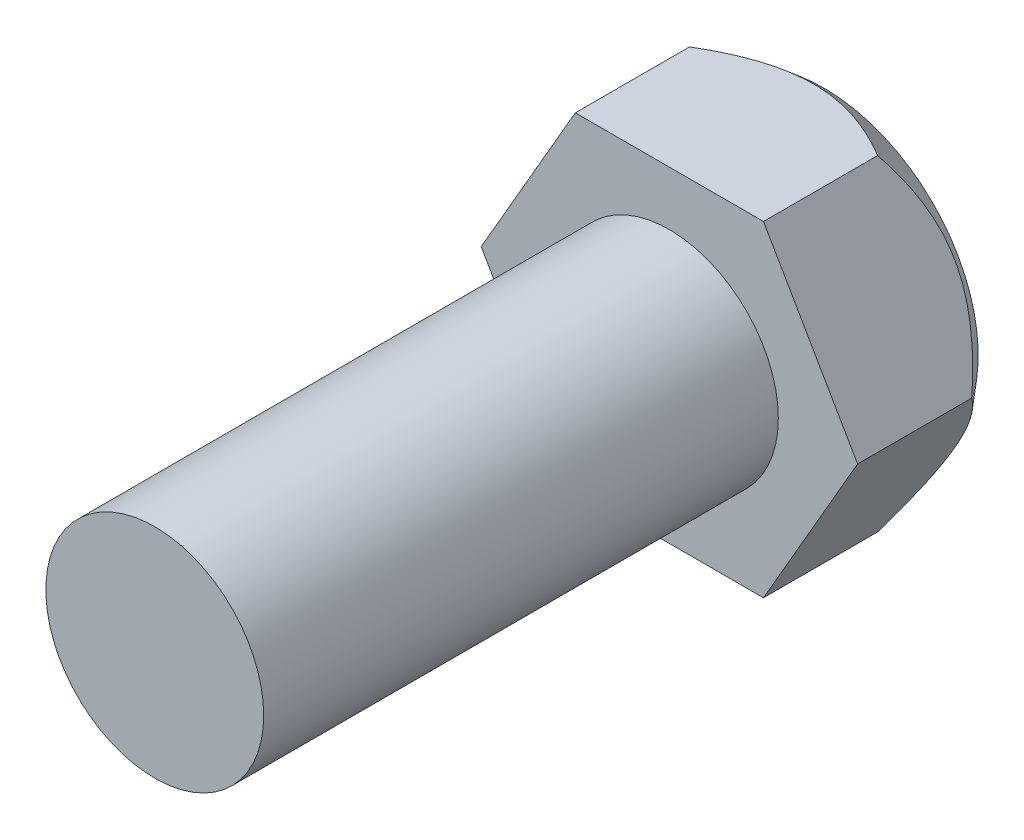
ISO-10303-21;
HEADER;
FILE_DESCRIPTION(('STEP AP214'),'2;1');
FILE_NAME('part.step','',(''),(''),'','','');
FILE_SCHEMA(('AUTOMOTIVE_DESIGN { 1 0 10303 214 1 1 1 1 }'));
ENDSEC;
DATA;
#1=APPLICATION_CONTEXT('core data for automotive mechanical design processes');
#2=APPLICATION_PROTOCOL_DEFINITION('international standard','automotive_design',2000,#1);
#3=PRODUCT_CONTEXT('',#1,'mechanical');
#4=PRODUCT('Part','Part','',(#3));
#5=PRODUCT_RELATED_PRODUCT_CATEGORY('part','',(#4));
#6=PRODUCT_DEFINITION_FORMATION('','',#4);
#7=PRODUCT_DEFINITION_CONTEXT('part definition',#1,'design');
#8=PRODUCT_DEFINITION('design','',#6,#7);
#9=PRODUCT_DEFINITION_SHAPE('','',#8);
#10=(LENGTH_UNIT() NAMED_UNIT(*) SI_UNIT(.MILLI.,.METRE.));
#11=(NAMED_UNIT(*) PLANE_ANGLE_UNIT() SI_UNIT($,.RADIAN.));
#12=(NAMED_UNIT(*) SI_UNIT($,.STERADIAN.) SOLID_ANGLE_UNIT());
#13=UNCERTAINTY_MEASURE_WITH_UNIT(LENGTH_MEASURE(1.E-05),#10,'distance_accuracy_value','');
#14=(GEOMETRIC_REPRESENTATION_CONTEXT(3) GLOBAL_UNCERTAINTY_ASSIGNED_CONTEXT((#13)) GLOBAL_UNIT_ASSIGNED_CONTEXT((#10,
#11,#12)) REPRESENTATION_CONTEXT('',''));
#15=CARTESIAN_POINT('',(0.,0.,0.));
#16=DIRECTION('',(0.,0.,1.));
#17=DIRECTION('',(1.,0.,0.));
#18=AXIS2_PLACEMENT_3D('',#15,#16,#17);
#19=CARTESIAN_POINT('',(5.48482755730144,-9.50000000000001,9.));
#20=DIRECTION('',(-0.866025403784439,0.5,0.));
#21=DIRECTION('',(-0.5,-0.866025403784439,0.));
#22=AXIS2_PLACEMENT_3D('',#19,#20,#21);
#23=PLANE('',#22);
#24=CARTESIAN_POINT('',(10.9697705846567,0.000199999999999126,2.34748117302384));
#25=CARTESIAN_POINT('',(10.8889631236256,-0.139762628136546,2.25119255660509));
#26=CARTESIAN_POINT('',(10.8074516206601,-0.280944692674171,2.15722410493489));
#27=CARTESIAN_POINT('',(10.6428919516378,-0.565970400297508,1.97465264818792));
#28=CARTESIAN_POINT('',(10.5598430773367,-0.70981527009836,1.88605220064243));
#29=CARTESIAN_POINT('',(10.3916269708672,-1.00117411315497,1.71449450025603));
#30=CARTESIAN_POINT('',(10.3064496747432,-1.148705517693,1.63157640770944));
#31=CARTESIAN_POINT('',(10.1344587779636,-1.4466024893547,1.47295144758015));
#32=CARTESIAN_POINT('',(10.0476453873572,-1.59696769266219,1.3972436617586));
#33=CARTESIAN_POINT('',(9.78407603193207,-2.05348320757677,1.18197003005541));
#34=CARTESIAN_POINT('',(9.60467446547095,-2.36421583564486,1.05475937532204));
#35=CARTESIAN_POINT('',(9.3312407472385,-2.83781692812593,0.895743862949519));
#36=CARTESIAN_POINT('',(9.23947448417499,-2.99676075817267,0.848072738226419));
#37=CARTESIAN_POINT('',(9.05463564466816,-3.31691101941057,0.764317767209321));
#38=CARTESIAN_POINT('',(8.96156335113909,-3.47811696057988,0.728231450636295));
#39=CARTESIAN_POINT('',(8.74867053636124,-3.84685813234147,0.660405624292135));
#40=CARTESIAN_POINT('',(8.62852975588101,-4.05494806819422,0.632587455626409));
#41=CARTESIAN_POINT('',(8.38745786775192,-4.47249682671035,0.59868379874282));
#42=CARTESIAN_POINT('',(8.26652662858869,-4.68195587716333,0.592602024187488));
#43=CARTESIAN_POINT('',(8.02554412999726,-5.09934980845859,0.602460285817408));
#44=CARTESIAN_POINT('',(7.90549164846371,-5.30728680604941,0.618281405205956));
#45=CARTESIAN_POINT('',(7.66656114341887,-5.72112658026518,0.670946349591678));
#46=CARTESIAN_POINT('',(7.5476831788669,-5.92702925476956,0.707791224556004));
#47=CARTESIAN_POINT('',(7.27901663014141,-6.39237336745628,0.813824983597897));
#48=CARTESIAN_POINT('',(7.12983472906172,-6.65076399969602,0.88916217615276));
#49=CARTESIAN_POINT('',(6.83555773220789,-7.16046670974564,1.0669119730065));
#50=CARTESIAN_POINT('',(6.69046491871772,-7.41177483452373,1.1693393787636));
#51=CARTESIAN_POINT('',(6.40416862365883,-7.90765456358446,1.39682940346883));
#52=CARTESIAN_POINT('',(6.26298312988891,-8.15219501208565,1.52198139490059));
#53=CARTESIAN_POINT('',(5.98502975498372,-8.63362437955669,1.79020900309984));
#54=CARTESIAN_POINT('',(5.84826040158438,-8.87051584856269,1.93327856721327));
#55=CARTESIAN_POINT('',(5.67500706386687,-9.17059943207032,2.12643782180611));
#56=CARTESIAN_POINT('',(5.63665791166208,-9.2370221121162,2.16996231272736));
#57=CARTESIAN_POINT('',(5.56039335536991,-9.36911619843093,2.25798168632233));
#58=CARTESIAN_POINT('',(5.52247699065834,-9.43478926854968,2.30247323861663));
#59=CARTESIAN_POINT('',(5.4847120872476,-9.50020000000001,2.34748117302384));
#60=B_SPLINE_CURVE_WITH_KNOTS('',3,(#24,#25,#26,#27,#28,#29,#30,#31,#32,#33,#34,#35,#36,#37,#38,
#39,#40,#41,#42,#43,#44,#45,#46,#47,#48,#49,#50,#51,#52,#53,#54,#55,#56,#57,#58,#59),
.UNSPECIFIED.,.F.,.F.,(4,2,2,2,2,2,2,2,2,2,2,2,2,2,2,2,2,4),(0.,0.56438501152082,
1.12903683762339,1.69725362189766,2.26539794623585,3.40495025474592,3.97351451521625,
4.5419574576039,5.26665033738531,5.99146702501464,6.71236388040615,7.43329674193717,
8.35490415251259,9.2770161517863,10.202836486913,11.1283449142103,11.3929028603484,
11.6566612332654),.UNSPECIFIED.);
#61=CARTESIAN_POINT('',(10.9696551146029,0.,2.34734355899955));
#62=VERTEX_POINT('',#61);
#63=CARTESIAN_POINT('',(5.48482755730144,-9.50000000000001,2.34734355899955));
#64=VERTEX_POINT('',#63);
#65=EDGE_CURVE('E50',#62,#64,#60,.T.);
#66=ORIENTED_EDGE('',*,*,#65,.F.);
#67=DIRECTION('',(0.,0.,-1.));
#68=VECTOR('',#67,1.);
#69=CARTESIAN_POINT('',(10.9696551146029,0.,9.));
#70=LINE('',#69,#68);
#71=CARTESIAN_POINT('',(10.9696551146029,0.,9.));
#72=VERTEX_POINT('',#71);
#73=EDGE_CURVE('E11',#72,#62,#70,.T.);
#74=ORIENTED_EDGE('',*,*,#73,.F.);
#75=DIRECTION('',(0.5,0.866025403784439,0.));
#76=VECTOR('',#75,1.);
#77=CARTESIAN_POINT('',(5.48482755730144,-9.50000000000001,9.));
#78=LINE('',#77,#76);
#79=CARTESIAN_POINT('',(5.48482755730144,-9.50000000000001,9.));
#80=VERTEX_POINT('',#79);
#81=EDGE_CURVE('E188',#80,#72,#78,.T.);
#82=ORIENTED_EDGE('',*,*,#81,.F.);
#83=DIRECTION('',(0.,0.,-1.));
#84=VECTOR('',#83,1.);
#85=CARTESIAN_POINT('',(5.48482755730144,-9.50000000000001,9.));
#86=LINE('',#85,#84);
#87=EDGE_CURVE('E107',#80,#64,#86,.T.);
#88=ORIENTED_EDGE('',*,*,#87,.T.);
#89=EDGE_LOOP('',(#66,#74,#82,#88));
#90=FACE_BOUND('',#89,.T.);
#91=ADVANCED_FACE('F35',(#90),#23,.F.);
#92=CARTESIAN_POINT('',(10.9696551146029,0.,9.));
#93=DIRECTION('',(-0.866025403784439,-0.5,0.));
#94=DIRECTION('',(0.5,-0.866025403784439,0.));
#95=AXIS2_PLACEMENT_3D('',#92,#93,#94);
#96=PLANE('',#95);
#97=CARTESIAN_POINT('',(5.48471208724761,9.5002,2.34748117302384));
#98=CARTESIAN_POINT('',(5.56551954827873,9.36023737186346,2.25119255660509));
#99=CARTESIAN_POINT('',(5.64703105124427,9.21905530732583,2.15722410493489));
#100=CARTESIAN_POINT('',(5.81159072026657,8.93402959970249,1.97465264818793));
#101=CARTESIAN_POINT('',(5.89463959456764,8.79018472990164,1.88605220064243));
#102=CARTESIAN_POINT('',(6.06285570103715,8.49882588684503,1.71449450025603));
#103=CARTESIAN_POINT('',(6.1480329971611,8.351294482307,1.63157640770944));
#104=CARTESIAN_POINT('',(6.32002389394076,8.0533975106453,1.47295144758015));
#105=CARTESIAN_POINT('',(6.4068372845471,7.90303230733781,1.39724366175861));
#106=CARTESIAN_POINT('',(6.67040663997227,7.44651679242323,1.18197003005541));
#107=CARTESIAN_POINT('',(6.84980820643338,7.13578416435514,1.05475937532204));
#108=CARTESIAN_POINT('',(7.12324192466583,6.66218307187407,0.895743862949518));
#109=CARTESIAN_POINT('',(7.21500818772935,6.50323924182733,0.848072738226418));
#110=CARTESIAN_POINT('',(7.39984702723618,6.18308898058942,0.764317767209322));
#111=CARTESIAN_POINT('',(7.49291932076524,6.02188303942012,0.728231450636296));
#112=CARTESIAN_POINT('',(7.70581213554309,5.65314186765853,0.660405624292135));
#113=CARTESIAN_POINT('',(7.82595291602333,5.44505193180578,0.632587455626409));
#114=CARTESIAN_POINT('',(8.06702480415241,5.02750317328965,0.598683798742819));
#115=CARTESIAN_POINT('',(8.18795604331565,4.81804412283666,0.592602024187487));
#116=CARTESIAN_POINT('',(8.42893854190708,4.4006501915414,0.602460285817408));
#117=CARTESIAN_POINT('',(8.54899102344062,4.19271319395058,0.618281405205957));
#118=CARTESIAN_POINT('',(8.78792152848547,3.77887341973482,0.670946349591679));
#119=CARTESIAN_POINT('',(8.90679949303744,3.57297074523044,0.707791224556005));
#120=CARTESIAN_POINT('',(9.17546604176293,3.10762663254371,0.813824983597896));
#121=CARTESIAN_POINT('',(9.32464794284262,2.84923600030397,0.88916217615276));
#122=CARTESIAN_POINT('',(9.61892493969644,2.33953329025436,1.0669119730065));
#123=CARTESIAN_POINT('',(9.76401775318662,2.08822516547627,1.1693393787636));
#124=CARTESIAN_POINT('',(10.0503140482455,1.59234543641554,1.39682940346883));
#125=CARTESIAN_POINT('',(10.1914995420154,1.34780498791434,1.52198139490059));
#126=CARTESIAN_POINT('',(10.4694529169206,0.866375620443301,1.79020900309984));
#127=CARTESIAN_POINT('',(10.60622227032,0.629484151437311,1.93327856721327));
#128=CARTESIAN_POINT('',(10.7794756080375,0.32940056792968,2.12643782180611));
#129=CARTESIAN_POINT('',(10.8178247602423,0.262977887883805,2.16996231272736));
#130=CARTESIAN_POINT('',(10.8940893165344,0.13088380156907,2.25798168632233));
#131=CARTESIAN_POINT('',(10.932005681246,0.0652107314503242,2.30247323861662));
#132=CARTESIAN_POINT('',(10.9697705846567,-0.00020000000000228,2.34748117302384));
#133=B_SPLINE_CURVE_WITH_KNOTS('',3,(#97,#98,#99,#100,#101,#102,#103,#104,#105,#106,#107,#108,
#109,#110,#111,#112,#113,#114,#115,#116,#117,#118,#119,#120,#121,#122,#123,#124,#125,#126,#127,
#128,#129,#130,#131,#132),.UNSPECIFIED.,.F.,.F.,(4,2,2,2,2,2,2,2,2,2,2,2,2,2,2,2,2,4),(0.,
0.564385011520822,1.12903683762339,1.69725362189766,2.26539794623586,3.40495025474592,
3.97351451521625,4.54195745760391,5.26665033738532,5.99146702501465,6.71236388040615,
7.43329674193718,8.3549041525126,9.27701615178632,10.2028364869131,11.1283449142103,
11.3929028603484,11.6566612332654),.UNSPECIFIED.);
#134=CARTESIAN_POINT('',(5.48482755730145,9.5,2.34734355899955));
#135=VERTEX_POINT('',#134);
#136=EDGE_CURVE('E128',#135,#62,#133,.T.);
#137=ORIENTED_EDGE('',*,*,#136,.F.);
#138=DIRECTION('',(0.,0.,-1.));
#139=VECTOR('',#138,1.);
#140=CARTESIAN_POINT('',(5.48482755730145,9.5,9.));
#141=LINE('',#140,#139);
#142=CARTESIAN_POINT('',(5.48482755730145,9.5,9.));
#143=VERTEX_POINT('',#142);
#144=EDGE_CURVE('E43',#143,#135,#141,.T.);
#145=ORIENTED_EDGE('',*,*,#144,.F.);
#146=DIRECTION('',(-0.5,0.866025403784439,0.));
#147=VECTOR('',#146,1.);
#148=CARTESIAN_POINT('',(10.9696551146029,0.,9.));
#149=LINE('',#148,#147);
#150=EDGE_CURVE('E127',#72,#143,#149,.T.);
#151=ORIENTED_EDGE('',*,*,#150,.F.);
#152=ORIENTED_EDGE('',*,*,#73,.T.);
#153=EDGE_LOOP('',(#137,#145,#151,#152));
#154=FACE_BOUND('',#153,.T.);
#155=ADVANCED_FACE('F126',(#154),#96,.F.);
#156=CARTESIAN_POINT('',(5.48482755730145,9.5,9.));
#157=DIRECTION('',(0.,-1.,0.));
#158=DIRECTION('',(1.,0.,0.));
#159=AXIS2_PLACEMENT_3D('',#156,#157,#158);
#160=PLANE('',#159);
#161=CARTESIAN_POINT('',(-10.7681035727974,9.5,6.38748615066247));
#162=CARTESIAN_POINT('',(-10.519290316109,9.5,6.16517777316281));
#163=CARTESIAN_POINT('',(-10.2688347119545,9.5,5.94467883301882));
#164=CARTESIAN_POINT('',(-9.76398312273237,9.5,5.50810966826671));
#165=CARTESIAN_POINT('',(-9.50958612975656,9.5,5.29204061043584));
#166=CARTESIAN_POINT('',(-8.99412158524951,9.5,4.86342551831856));
#167=CARTESIAN_POINT('',(-8.73301551542346,9.5,4.65092565764778));
#168=CARTESIAN_POINT('',(-8.20553096549107,9.5,4.23259853938085));
#169=CARTESIAN_POINT('',(-7.93915290637596,9.5,4.02677075242545));
#170=CARTESIAN_POINT('',(-7.38505691052174,9.5,3.6119587820503));
#171=CARTESIAN_POINT('',(-7.09698187617145,9.5,3.40344930755562));
#172=CARTESIAN_POINT('',(-6.51269668841927,9.5,2.99796175837351));
#173=CARTESIAN_POINT('',(-6.21648498824425,9.5,2.8009858988175));
#174=CARTESIAN_POINT('',(-5.61570779482363,9.5,2.42252590657691));
#175=CARTESIAN_POINT('',(-5.31117524419953,9.5,2.24098986330625));
#176=CARTESIAN_POINT('',(-4.69158790523013,9.5,1.89701412326009));
#177=CARTESIAN_POINT('',(-4.37653877681122,9.5,1.73456436060275));
#178=CARTESIAN_POINT('',(-3.81367362682312,9.5,1.47119998935354));
#179=CARTESIAN_POINT('',(-3.56836303555361,9.5,1.36497420288798));
#180=CARTESIAN_POINT('',(-3.19539430670949,9.5,1.21834607604793));
#181=CARTESIAN_POINT('',(-3.07022566364014,9.5,1.17158468490425));
#182=CARTESIAN_POINT('',(-2.81821055883197,9.5,1.08267441874355));
#183=CARTESIAN_POINT('',(-2.69136348815049,9.5,1.04052727225815));
#184=CARTESIAN_POINT('',(-2.31129382328237,9.5,0.922518694070893));
#185=CARTESIAN_POINT('',(-2.05573661609763,9.5,0.853971125557394));
#186=CARTESIAN_POINT('',(-1.53962951679316,9.5,0.73962186332583));
#187=CARTESIAN_POINT('',(-1.27908159579638,9.5,0.693811374250513));
#188=CARTESIAN_POINT('',(-0.781744371475834,9.5,0.630724663342835));
#189=CARTESIAN_POINT('',(-0.545267802468872,9.5,0.610998152788053));
#190=CARTESIAN_POINT('',(-0.0715083923209196,9.5,0.592682782762691));
#191=CARTESIAN_POINT('',(0.165774358186825,9.5,0.594091621000563));
#192=CARTESIAN_POINT('',(0.639560229433643,9.5,0.617993057487313));
#193=CARTESIAN_POINT('',(0.876062008053896,9.5,0.640511959498016));
#194=CARTESIAN_POINT('',(1.34628444787561,9.5,0.705606539356792));
#195=CARTESIAN_POINT('',(1.58000458525725,9.5,0.748185935455673));
#196=CARTESIAN_POINT('',(2.120878560086,9.5,0.868941091784143));
#197=CARTESIAN_POINT('',(2.42643893016145,9.5,0.954260133743078));
#198=CARTESIAN_POINT('',(3.02853010532176,9.5,1.15224364217958));
#199=CARTESIAN_POINT('',(3.32505638025887,9.5,1.26492158179527));
#200=CARTESIAN_POINT('',(3.91212807142735,9.5,1.51385516995853));
#201=CARTESIAN_POINT('',(4.20255990716701,9.5,1.65037610493409));
#202=CARTESIAN_POINT('',(4.63119101615597,9.5,1.86859343680778));
#203=CARTESIAN_POINT('',(4.77288377526247,9.5,1.94356309884775));
#204=CARTESIAN_POINT('',(5.05407574724106,9.5,2.09751322708265));
#205=CARTESIAN_POINT('',(5.19357497679054,9.5,2.17649366276439));
#206=CARTESIAN_POINT('',(5.5679524356798,9.5,2.39486361812823));
#207=CARTESIAN_POINT('',(5.80085403576646,9.5,2.53764450777493));
#208=CARTESIAN_POINT('',(6.26124522840037,9.5,2.83171415228251));
#209=CARTESIAN_POINT('',(6.48873384238482,9.5,2.98300442909431));
#210=CARTESIAN_POINT('',(6.93902303247019,9.5,3.29271617148989));
#211=CARTESIAN_POINT('',(7.16182022398099,9.5,3.45114254301658));
#212=CARTESIAN_POINT('',(7.60310617484855,9.5,3.77384244681173));
#213=CARTESIAN_POINT('',(7.8215951736152,9.5,3.93811565273557));
#214=CARTESIAN_POINT('',(8.25566144714915,9.5,4.27225452947675));
#215=CARTESIAN_POINT('',(8.47122328427096,9.5,4.44214021111729));
#216=CARTESIAN_POINT('',(8.89897491584893,9.5,4.78611099032422));
#217=CARTESIAN_POINT('',(9.11116457975042,9.5,4.96019624982471));
#218=CARTESIAN_POINT('',(9.74311019391394,9.5,5.48765176988434));
#219=CARTESIAN_POINT('',(10.1584165141001,9.5,5.84635710612678));
#220=CARTESIAN_POINT('',(10.9464663675653,9.5,6.54484928513815));
#221=CARTESIAN_POINT('',(11.3199369711359,9.5,6.88382190232228));
#222=CARTESIAN_POINT('',(12.0604906625077,9.5,7.56873743211226));
#223=CARTESIAN_POINT('',(12.4275731021824,9.5,7.91468104438172));
#224=CARTESIAN_POINT('',(13.1530834543696,9.5,8.60882843074878));
#225=CARTESIAN_POINT('',(13.5115600743294,9.5,8.95698141018574));
#226=CARTESIAN_POINT('',(14.0460106823566,9.5,9.48244823877507));
#227=CARTESIAN_POINT('',(14.2235986462197,9.5,9.65812508472786));
#228=CARTESIAN_POINT('',(14.5777864853237,9.5,10.0104686077979));
#229=CARTESIAN_POINT('',(14.7543863706048,9.5,10.1871352748206));
#230=CARTESIAN_POINT('',(14.9305376742951,9.5,10.3642481907117));
#231=B_SPLINE_CURVE_WITH_KNOTS('',3,(#161,#162,#163,#164,#165,#166,#167,#168,#169,#170,#171,
#172,#173,#174,#175,#176,#177,#178,#179,#180,#181,#182,#183,#184,#185,#186,#187,#188,#189,#190,
#191,#192,#193,#194,#195,#196,#197,#198,#199,#200,#201,#202,#203,#204,#205,#206,#207,#208,#209,
#210,#211,#212,#213,#214,#215,#216,#217,#218,#219,#220,#221,#222,#223,#224,#225,#226,#227,#228,
#229,#230),.UNSPECIFIED.,.F.,.F.,(4,2,2,2,2,2,2,2,2,2,2,2,2,2,2,2,2,2,2,2,2,2,2,2,2,2,2,2,2,2,2,
2,2,2,4),(0.,1.00099974266836,2.00225983460369,3.01211625498083,4.0218923567346,
5.08851904306909,6.15534991693199,7.21843913398539,8.28096514928983,9.08236103083373,
9.48313385548195,9.88405630268361,10.6768616244238,11.4693600267432,12.1803446478739,
12.8912518214065,13.6030459853102,14.3149721335545,15.2650893830792,16.2156754788681,
17.1776039433299,17.6584649305307,18.1393222599821,18.9586336261087,19.7780919994816,
20.5981226013929,21.418107504353,22.2414240936668,23.0647724806521,24.7108089296457,
26.2238042542963,27.7369521989234,29.236053207315,29.9854488269368,30.7348368178243),.UNSPECIFIED.);
#232=CARTESIAN_POINT('',(-5.48482755730144,9.5,2.34734355899955));
#233=VERTEX_POINT('',#232);
#234=EDGE_CURVE('E122',#233,#135,#231,.T.);
#235=ORIENTED_EDGE('',*,*,#234,.F.);
#236=DIRECTION('',(0.,0.,-1.));
#237=VECTOR('',#236,1.);
#238=CARTESIAN_POINT('',(-5.48482755730144,9.5,9.));
#239=LINE('',#238,#237);
#240=CARTESIAN_POINT('',(-5.48482755730144,9.5,9.));
#241=VERTEX_POINT('',#240);
#242=EDGE_CURVE('E109',#241,#233,#239,.T.);
#243=ORIENTED_EDGE('',*,*,#242,.F.);
#244=DIRECTION('',(-1.,0.,0.));
#245=VECTOR('',#244,1.);
#246=CARTESIAN_POINT('',(5.48482755730145,9.5,9.));
#247=LINE('',#246,#245);
#248=EDGE_CURVE('E123',#143,#241,#247,.T.);
#249=ORIENTED_EDGE('',*,*,#248,.F.);
#250=ORIENTED_EDGE('',*,*,#144,.T.);
#251=EDGE_LOOP('',(#235,#243,#249,#250));
#252=FACE_BOUND('',#251,.T.);
#253=ADVANCED_FACE('F120',(#252),#160,.F.);
#254=CARTESIAN_POINT('',(-5.48482755730144,9.5,9.));
#255=DIRECTION('',(0.866025403784439,-0.5,0.));
#256=DIRECTION('',(0.5,0.866025403784439,0.));
#257=AXIS2_PLACEMENT_3D('',#254,#255,#256);
#258=PLANE('',#257);
#259=CARTESIAN_POINT('',(-10.9697705846567,-0.000200000000001887,2.34748117302384));
#260=CARTESIAN_POINT('',(-10.8889631236256,0.139762628136542,2.25119255660509));
#261=CARTESIAN_POINT('',(-10.8074516206601,0.280944692674167,2.15722410493489));
#262=CARTESIAN_POINT('',(-10.6428919516378,0.565970400297505,1.97465264818793));
#263=CARTESIAN_POINT('',(-10.5598430773367,0.709815270098358,1.88605220064243));
#264=CARTESIAN_POINT('',(-10.3916269708672,1.00117411315497,1.71449450025603));
#265=CARTESIAN_POINT('',(-10.3064496747432,1.148705517693,1.63157640770944));
#266=CARTESIAN_POINT('',(-10.1344587779636,1.4466024893547,1.47295144758014));
#267=CARTESIAN_POINT('',(-10.0476453873572,1.59696769266219,1.3972436617586));
#268=CARTESIAN_POINT('',(-9.78407603193206,2.05348320757677,1.18197003005541));
#269=CARTESIAN_POINT('',(-9.60467446547095,2.36421583564486,1.05475937532204));
#270=CARTESIAN_POINT('',(-9.3312407472385,2.83781692812593,0.895743862949516));
#271=CARTESIAN_POINT('',(-9.23947448417499,2.99676075817267,0.848072738226417));
#272=CARTESIAN_POINT('',(-9.05463564466816,3.31691101941057,0.76431776720932));
#273=CARTESIAN_POINT('',(-8.96156335113909,3.47811696057988,0.728231450636294));
#274=CARTESIAN_POINT('',(-8.74867053636124,3.84685813234146,0.660405624292134));
#275=CARTESIAN_POINT('',(-8.628529755881,4.05494806819421,0.632587455626408));
#276=CARTESIAN_POINT('',(-8.38745786775192,4.47249682671035,0.59868379874282));
#277=CARTESIAN_POINT('',(-8.26652662858869,4.68195587716333,0.592602024187487));
#278=CARTESIAN_POINT('',(-8.02554412999726,5.09934980845859,0.602460285817407));
#279=CARTESIAN_POINT('',(-7.90549164846371,5.30728680604941,0.618281405205956));
#280=CARTESIAN_POINT('',(-7.66656114341887,5.72112658026518,0.670946349591678));
#281=CARTESIAN_POINT('',(-7.5476831788669,5.92702925476956,0.707791224556005));
#282=CARTESIAN_POINT('',(-7.27901663014141,6.39237336745628,0.813824983597897));
#283=CARTESIAN_POINT('',(-7.12983472906172,6.65076399969602,0.88916217615276));
#284=CARTESIAN_POINT('',(-6.83555773220789,7.16046670974564,1.0669119730065));
#285=CARTESIAN_POINT('',(-6.69046491871772,7.41177483452373,1.1693393787636));
#286=CARTESIAN_POINT('',(-6.40416862365883,7.90765456358446,1.39682940346883));
#287=CARTESIAN_POINT('',(-6.26298312988891,8.15219501208565,1.52198139490059));
#288=CARTESIAN_POINT('',(-5.98502975498372,8.63362437955669,1.79020900309984));
#289=CARTESIAN_POINT('',(-5.84826040158438,8.87051584856268,1.93327856721327));
#290=CARTESIAN_POINT('',(-5.67500706386686,9.17059943207031,2.12643782180611));
#291=CARTESIAN_POINT('',(-5.63665791166208,9.23702211211619,2.16996231272736));
#292=CARTESIAN_POINT('',(-5.56039335536991,9.36911619843093,2.25798168632233));
#293=CARTESIAN_POINT('',(-5.52247699065834,9.43478926854968,2.30247323861662));
#294=CARTESIAN_POINT('',(-5.4847120872476,9.5002,2.34748117302384));
#295=B_SPLINE_CURVE_WITH_KNOTS('',3,(#259,#260,#261,#262,#263,#264,#265,#266,#267,#268,#269,
#270,#271,#272,#273,#274,#275,#276,#277,#278,#279,#280,#281,#282,#283,#284,#285,#286,#287,#288,
#289,#290,#291,#292,#293,#294),.UNSPECIFIED.,.F.,.F.,(4,2,2,2,2,2,2,2,2,2,2,2,2,2,2,2,2,4),(0.,
0.564385011520821,1.12903683762339,1.69725362189767,2.26539794623586,3.40495025474593,
3.97351451521625,4.54195745760391,5.26665033738531,5.99146702501465,6.71236388040615,
7.43329674193718,8.3549041525126,9.27701615178631,10.202836486913,11.1283449142103,
11.3929028603484,11.6566612332654),.UNSPECIFIED.);
#296=CARTESIAN_POINT('',(-10.9696551146029,0.,2.34734355899955));
#297=VERTEX_POINT('',#296);
#298=EDGE_CURVE('E104',#297,#233,#295,.T.);
#299=ORIENTED_EDGE('',*,*,#298,.F.);
#300=DIRECTION('',(0.,0.,-1.));
#301=VECTOR('',#300,1.);
#302=CARTESIAN_POINT('',(-10.9696551146029,0.,9.));
#303=LINE('',#302,#301);
#304=CARTESIAN_POINT('',(-10.9696551146029,0.,9.));
#305=VERTEX_POINT('',#304);
#306=EDGE_CURVE('E103',#305,#297,#303,.T.);
#307=ORIENTED_EDGE('',*,*,#306,.F.);
#308=DIRECTION('',(-0.5,-0.866025403784439,0.));
#309=VECTOR('',#308,1.);
#310=CARTESIAN_POINT('',(-5.48482755730144,9.5,9.));
#311=LINE('',#310,#309);
#312=EDGE_CURVE('E196',#241,#305,#311,.T.);
#313=ORIENTED_EDGE('',*,*,#312,.F.);
#314=ORIENTED_EDGE('',*,*,#242,.T.);
#315=EDGE_LOOP('',(#299,#307,#313,#314));
#316=FACE_BOUND('',#315,.T.);
#317=ADVANCED_FACE('F173',(#316),#258,.F.);
#318=CARTESIAN_POINT('',(-10.9696551146029,0.,9.));
#319=DIRECTION('',(0.866025403784439,0.5,0.));
#320=DIRECTION('',(-0.5,0.866025403784439,0.));
#321=AXIS2_PLACEMENT_3D('',#318,#319,#320);
#322=PLANE('',#321);
#323=CARTESIAN_POINT('',(-5.48471208724761,-9.5002,2.34748117302384));
#324=CARTESIAN_POINT('',(-5.56551954827873,-9.36023737186346,2.25119255660509));
#325=CARTESIAN_POINT('',(-5.64703105124428,-9.21905530732583,2.1572241049349));
#326=CARTESIAN_POINT('',(-5.81159072026657,-8.93402959970249,1.97465264818793));
#327=CARTESIAN_POINT('',(-5.89463959456764,-8.79018472990164,1.88605220064243));
#328=CARTESIAN_POINT('',(-6.06285570103715,-8.49882588684503,1.71449450025603));
#329=CARTESIAN_POINT('',(-6.14803299716111,-8.35129448230701,1.63157640770944));
#330=CARTESIAN_POINT('',(-6.32002389394077,-8.0533975106453,1.47295144758015));
#331=CARTESIAN_POINT('',(-6.4068372845471,-7.90303230733781,1.39724366175861));
#332=CARTESIAN_POINT('',(-6.67040663997227,-7.44651679242324,1.18197003005541));
#333=CARTESIAN_POINT('',(-6.84980820643338,-7.13578416435514,1.05475937532204));
#334=CARTESIAN_POINT('',(-7.12324192466583,-6.66218307187407,0.895743862949523));
#335=CARTESIAN_POINT('',(-7.21500818772934,-6.50323924182733,0.848072738226423));
#336=CARTESIAN_POINT('',(-7.39984702723618,-6.18308898058943,0.764317767209326));
#337=CARTESIAN_POINT('',(-7.49291932076524,-6.02188303942013,0.728231450636299));
#338=CARTESIAN_POINT('',(-7.70581213554309,-5.65314186765854,0.660405624292139));
#339=CARTESIAN_POINT('',(-7.82595291602333,-5.44505193180579,0.632587455626414));
#340=CARTESIAN_POINT('',(-8.06702480415241,-5.02750317328966,0.598683798742825));
#341=CARTESIAN_POINT('',(-8.18795604331564,-4.81804412283668,0.592602024187491));
#342=CARTESIAN_POINT('',(-8.42893854190708,-4.40065019154142,0.602460285817409));
#343=CARTESIAN_POINT('',(-8.54899102344062,-4.19271319395059,0.618281405205958));
#344=CARTESIAN_POINT('',(-8.78792152848547,-3.77887341973483,0.67094634959168));
#345=CARTESIAN_POINT('',(-8.90679949303743,-3.57297074523045,0.707791224556006));
#346=CARTESIAN_POINT('',(-9.17546604176292,-3.10762663254372,0.813824983597897));
#347=CARTESIAN_POINT('',(-9.32464794284261,-2.84923600030398,0.889162176152759));
#348=CARTESIAN_POINT('',(-9.61892493969644,-2.33953329025437,1.0669119730065));
#349=CARTESIAN_POINT('',(-9.76401775318661,-2.08822516547628,1.1693393787636));
#350=CARTESIAN_POINT('',(-10.0503140482455,-1.59234543641555,1.39682940346883));
#351=CARTESIAN_POINT('',(-10.1914995420154,-1.34780498791436,1.52198139490059));
#352=CARTESIAN_POINT('',(-10.4694529169206,-0.866375620443313,1.79020900309984));
#353=CARTESIAN_POINT('',(-10.60622227032,-0.629484151437322,1.93327856721326));
#354=CARTESIAN_POINT('',(-10.7794756080375,-0.329400567929691,2.12643782180611));
#355=CARTESIAN_POINT('',(-10.8178247602423,-0.262977887883815,2.16996231272736));
#356=CARTESIAN_POINT('',(-10.8940893165344,-0.130883801569077,2.25798168632233));
#357=CARTESIAN_POINT('',(-10.932005681246,-0.0652107314503293,2.30247323861662));
#358=CARTESIAN_POINT('',(-10.9697705846567,0.000199999999999711,2.34748117302384));
#359=B_SPLINE_CURVE_WITH_KNOTS('',3,(#323,#324,#325,#326,#327,#328,#329,#330,#331,#332,#333,
#334,#335,#336,#337,#338,#339,#340,#341,#342,#343,#344,#345,#346,#347,#348,#349,#350,#351,#352,
#353,#354,#355,#356,#357,#358),.UNSPECIFIED.,.F.,.F.,(4,2,2,2,2,2,2,2,2,2,2,2,2,2,2,2,2,4),(0.,
0.564385011520822,1.12903683762339,1.69725362189766,2.26539794623585,3.40495025474592,
3.97351451521625,4.5419574576039,5.2666503373853,5.99146702501464,6.71236388040614,
7.43329674193717,8.35490415251259,9.2770161517863,10.202836486913,11.1283449142103,
11.3929028603484,11.6566612332654),.UNSPECIFIED.);
#360=CARTESIAN_POINT('',(-5.48482755730145,-9.5,2.34734355899955));
#361=VERTEX_POINT('',#360);
#362=EDGE_CURVE('E89',#361,#297,#359,.T.);
#363=ORIENTED_EDGE('',*,*,#362,.F.);
#364=DIRECTION('',(0.,0.,-1.));
#365=VECTOR('',#364,1.);
#366=CARTESIAN_POINT('',(-5.48482755730145,-9.5,9.));
#367=LINE('',#366,#365);
#368=CARTESIAN_POINT('',(-5.48482755730145,-9.5,9.));
#369=VERTEX_POINT('',#368);
#370=EDGE_CURVE('E101',#369,#361,#367,.T.);
#371=ORIENTED_EDGE('',*,*,#370,.F.);
#372=DIRECTION('',(0.5,-0.866025403784439,0.));
#373=VECTOR('',#372,1.);
#374=CARTESIAN_POINT('',(-10.9696551146029,0.,9.));
#375=LINE('',#374,#373);
#376=EDGE_CURVE('E198',#305,#369,#375,.T.);
#377=ORIENTED_EDGE('',*,*,#376,.F.);
#378=ORIENTED_EDGE('',*,*,#306,.T.);
#379=EDGE_LOOP('',(#363,#371,#377,#378));
#380=FACE_BOUND('',#379,.T.);
#381=ADVANCED_FACE('F99',(#380),#322,.F.);
#382=CARTESIAN_POINT('',(-5.48482755730145,-9.5,9.));
#383=DIRECTION('',(0.,1.,0.));
#384=DIRECTION('',(-1.,0.,0.));
#385=AXIS2_PLACEMENT_3D('',#382,#383,#384);
#386=PLANE('',#385);
#387=CARTESIAN_POINT('',(-10.7681035727921,-9.5,6.38748615065773));
#388=CARTESIAN_POINT('',(-10.5192903161039,-9.5,6.16517777315825));
#389=CARTESIAN_POINT('',(-10.2688347119495,-9.5,5.94467883301444));
#390=CARTESIAN_POINT('',(-9.76398312272768,-9.5,5.5081096682627));
#391=CARTESIAN_POINT('',(-9.50958612975202,-9.5,5.29204061043202));
#392=CARTESIAN_POINT('',(-8.9941215852453,-9.5,4.86342551831511));
#393=CARTESIAN_POINT('',(-8.73301551541942,-9.5,4.65092565764452));
#394=CARTESIAN_POINT('',(-8.20553096548735,-9.5,4.23259853937796));
#395=CARTESIAN_POINT('',(-7.93915290637242,-9.5,4.02677075242274));
#396=CARTESIAN_POINT('',(-7.38505691051857,-9.5,3.61195878204799));
#397=CARTESIAN_POINT('',(-7.09698187616848,-9.5,3.40344930755351));
#398=CARTESIAN_POINT('',(-6.51269668841673,-9.5,2.99796175837179));
#399=CARTESIAN_POINT('',(-6.21648498824193,-9.5,2.80098589881598));
#400=CARTESIAN_POINT('',(-5.61570779482175,-9.5,2.42252590657577));
#401=CARTESIAN_POINT('',(-5.31117524419788,-9.5,2.24098986330529));
#402=CARTESIAN_POINT('',(-4.69158790522894,-9.5,1.89701412325947));
#403=CARTESIAN_POINT('',(-4.37653877681028,-9.5,1.73456436060229));
#404=CARTESIAN_POINT('',(-3.81367362682253,-9.5,1.47119998935328));
#405=CARTESIAN_POINT('',(-3.56836303555313,-9.5,1.36497420288778));
#406=CARTESIAN_POINT('',(-3.19539430670918,-9.5,1.21834607604781));
#407=CARTESIAN_POINT('',(-3.07022566363989,-9.5,1.17158468490416));
#408=CARTESIAN_POINT('',(-2.81821055883183,-9.5,1.0826744187435));
#409=CARTESIAN_POINT('',(-2.6913634881504,-9.5,1.04052727225812));
#410=CARTESIAN_POINT('',(-2.31129382328246,-9.50000000000001,0.92251869407092));
#411=CARTESIAN_POINT('',(-2.05573661609784,-9.5,0.853971125557448));
#412=CARTESIAN_POINT('',(-1.5396295167936,-9.5,0.739621863325916));
#413=CARTESIAN_POINT('',(-1.27908159579694,-9.5,0.693811374250605));
#414=CARTESIAN_POINT('',(-0.781744371476506,-9.5,0.6307246633429));
#415=CARTESIAN_POINT('',(-0.545267802469537,-9.5,0.610998152788098));
#416=CARTESIAN_POINT('',(-0.0715083923215666,-9.5,0.592682782762698));
#417=CARTESIAN_POINT('',(0.165774358186188,-9.5,0.594091621000551));
#418=CARTESIAN_POINT('',(0.639560229433026,-9.5,0.617993057487266));
#419=CARTESIAN_POINT('',(0.87606200805329,-9.5,0.64051195949795));
#420=CARTESIAN_POINT('',(1.34628444787503,-9.5,0.705606539356695));
#421=CARTESIAN_POINT('',(1.58000458525668,-9.5,0.748185935455563));
#422=CARTESIAN_POINT('',(2.12087856008542,-9.5,0.868941091783996));
#423=CARTESIAN_POINT('',(2.42643893016085,-9.5,0.954260133742905));
#424=CARTESIAN_POINT('',(3.02853010532111,-9.5,1.15224364217935));
#425=CARTESIAN_POINT('',(3.3250563802582,-9.50000000000001,1.264921581795));
#426=CARTESIAN_POINT('',(3.91212807142665,-9.50000000000001,1.51385516995821));
#427=CARTESIAN_POINT('',(4.20255990716629,-9.50000000000001,1.65037610493374));
#428=CARTESIAN_POINT('',(4.63119101615522,-9.50000000000001,1.86859343680739));
#429=CARTESIAN_POINT('',(4.7728837752617,-9.50000000000001,1.94356309884734));
#430=CARTESIAN_POINT('',(5.05407574724028,-9.50000000000001,2.09751322708221));
#431=CARTESIAN_POINT('',(5.19357497678975,-9.50000000000001,2.17649366276394));
#432=CARTESIAN_POINT('',(5.56795243567895,-9.50000000000001,2.39486361812772));
#433=CARTESIAN_POINT('',(5.80085403576556,-9.50000000000001,2.53764450777437));
#434=CARTESIAN_POINT('',(6.26124522839937,-9.50000000000001,2.83171415228186));
#435=CARTESIAN_POINT('',(6.48873384238377,-9.50000000000001,2.98300442909361));
#436=CARTESIAN_POINT('',(6.93902303246905,-9.50000000000001,3.29271617148909));
#437=CARTESIAN_POINT('',(7.16182022397979,-9.50000000000001,3.45114254301572));
#438=CARTESIAN_POINT('',(7.60310617484726,-9.50000000000001,3.77384244681078));
#439=CARTESIAN_POINT('',(7.82159517361386,-9.50000000000001,3.93811565273456));
#440=CARTESIAN_POINT('',(8.25566144714772,-9.50000000000001,4.27225452947564));
#441=CARTESIAN_POINT('',(8.47122328426948,-9.50000000000001,4.44214021111612));
#442=CARTESIAN_POINT('',(8.89897491584736,-9.50000000000001,4.78611099032295));
#443=CARTESIAN_POINT('',(9.1111645797488,-9.50000000000001,4.96019624982338));
#444=CARTESIAN_POINT('',(9.74311019391219,-9.50000000000001,5.48765176988285));
#445=CARTESIAN_POINT('',(10.1584165140983,-9.50000000000001,5.84635710612519));
#446=CARTESIAN_POINT('',(10.9464663675633,-9.50000000000001,6.54484928513635));
#447=CARTESIAN_POINT('',(11.3199369711338,-9.50000000000001,6.88382190232039));
#448=CARTESIAN_POINT('',(12.0604906625054,-9.50000000000001,7.56873743211018));
#449=CARTESIAN_POINT('',(12.4275731021801,-9.50000000000001,7.91468104437955));
#450=CARTESIAN_POINT('',(13.1530834543671,-9.50000000000001,8.60882843074642));
#451=CARTESIAN_POINT('',(13.5115600743268,-9.50000000000001,8.95698141018328));
#452=CARTESIAN_POINT('',(14.046010682354,-9.50000000000001,9.48244823877247));
#453=CARTESIAN_POINT('',(14.223598646217,-9.50000000000001,9.65812508472521));
#454=CARTESIAN_POINT('',(14.5777864853209,-9.50000000000001,10.0104686077951));
#455=CARTESIAN_POINT('',(14.754386370602,-9.50000000000001,10.1871352748178));
#456=CARTESIAN_POINT('',(14.9305376742923,-9.50000000000001,10.3642481907089));
#457=B_SPLINE_CURVE_WITH_KNOTS('',3,(#387,#388,#389,#390,#391,#392,#393,#394,#395,#396,#397,
#398,#399,#400,#401,#402,#403,#404,#405,#406,#407,#408,#409,#410,#411,#412,#413,#414,#415,#416,
#417,#418,#419,#420,#421,#422,#423,#424,#425,#426,#427,#428,#429,#430,#431,#432,#433,#434,#435,
#436,#437,#438,#439,#440,#441,#442,#443,#444,#445,#446,#447,#448,#449,#450,#451,#452,#453,#454,
#455,#456),.UNSPECIFIED.,.F.,.F.,(4,2,2,2,2,2,2,2,2,2,2,2,2,2,2,2,2,2,2,2,2,2,2,2,2,2,2,2,2,2,2,
2,2,2,4),(0.,1.00099974266764,2.00225983460225,3.01211625497866,4.02189235673169,
5.08851904306532,6.15534991692735,7.21843913397989,8.28096514928347,9.082361030827,
9.48313385547503,9.88405630267651,10.6768616244164,11.4693600267354,12.1803446478661,
12.8912518213988,13.6030459853025,14.3149721335468,15.2650893830714,16.2156754788602,
17.1776039433219,17.6584649305227,18.1393222599741,18.9586336261004,19.7780919994731,
20.5981226013842,21.4181075043442,22.2414240936577,23.0647724806428,24.710808929636,
26.2238042542863,27.736952198913,29.2360532073043,29.9854488269258,30.7348368178132),.UNSPECIFIED.);
#458=EDGE_CURVE('E86',#64,#361,#457,.F.);
#459=ORIENTED_EDGE('',*,*,#458,.F.);
#460=ORIENTED_EDGE('',*,*,#87,.F.);
#461=DIRECTION('',(1.,0.,0.));
#462=VECTOR('',#461,1.);
#463=CARTESIAN_POINT('',(-5.48482755730145,-9.5,9.));
#464=LINE('',#463,#462);
#465=EDGE_CURVE('E58',#369,#80,#464,.T.);
#466=ORIENTED_EDGE('',*,*,#465,.F.);
#467=ORIENTED_EDGE('',*,*,#370,.T.);
#468=EDGE_LOOP('',(#459,#460,#466,#467));
#469=FACE_BOUND('',#468,.T.);
#470=ADVANCED_FACE('F106',(#469),#386,.F.);
#471=CARTESIAN_POINT('',(0.,0.,9.));
#472=DIRECTION('',(0.,0.,1.));
#473=DIRECTION('',(1.,0.,0.));
#474=AXIS2_PLACEMENT_3D('',#471,#472,#473);
#475=PLANE('',#474);
#476=CARTESIAN_POINT('',(0.,0.,9.));
#477=DIRECTION('',(0.,0.,1.));
#478=DIRECTION('',(1.,0.,0.));
#479=AXIS2_PLACEMENT_3D('',#476,#477,#478);
#480=CIRCLE('',#479,6.35);
#481=CARTESIAN_POINT('',(6.35,0.,9.));
#482=VERTEX_POINT('',#481);
#483=EDGE_CURVE('E131',#482,#482,#480,.T.);
#484=ORIENTED_EDGE('',*,*,#483,.F.);
#485=EDGE_LOOP('',(#484));
#486=FACE_BOUND('',#485,.T.);
#487=ORIENTED_EDGE('',*,*,#81,.T.);
#488=ORIENTED_EDGE('',*,*,#150,.T.);
#489=ORIENTED_EDGE('',*,*,#248,.T.);
#490=ORIENTED_EDGE('',*,*,#312,.T.);
#491=ORIENTED_EDGE('',*,*,#376,.T.);
#492=ORIENTED_EDGE('',*,*,#465,.T.);
#493=EDGE_LOOP('',(#487,#488,#489,#490,#491,#492));
#494=FACE_BOUND('',#493,.T.);
#495=ADVANCED_FACE('F199',(#486,#494),#475,.T.);
#496=CARTESIAN_POINT('',(0.,0.,39.));
#497=DIRECTION('',(0.,0.,-1.));
#498=DIRECTION('',(-1.,0.,0.));
#499=AXIS2_PLACEMENT_3D('',#496,#497,#498);
#500=CYLINDRICAL_SURFACE('',#499,6.35);
#501=CARTESIAN_POINT('',(0.,0.,39.));
#502=DIRECTION('',(0.,0.,1.));
#503=DIRECTION('',(1.,0.,0.));
#504=AXIS2_PLACEMENT_3D('',#501,#502,#503);
#505=CIRCLE('',#504,6.35);
#506=CARTESIAN_POINT('',(6.35,0.,39.));
#507=VERTEX_POINT('',#506);
#508=EDGE_CURVE('E189',#507,#507,#505,.T.);
#509=ORIENTED_EDGE('',*,*,#508,.F.);
#510=EDGE_LOOP('',(#509));
#511=FACE_BOUND('',#510,.T.);
#512=ORIENTED_EDGE('',*,*,#483,.T.);
#513=EDGE_LOOP('',(#512));
#514=FACE_BOUND('',#513,.T.);
#515=ADVANCED_FACE('F202',(#511,#514),#500,.T.);
#516=CARTESIAN_POINT('',(0.,0.,39.));
#517=DIRECTION('',(0.,0.,1.));
#518=DIRECTION('',(1.,0.,0.));
#519=AXIS2_PLACEMENT_3D('',#516,#517,#518);
#520=PLANE('',#519);
#521=ORIENTED_EDGE('',*,*,#508,.T.);
#522=EDGE_LOOP('',(#521));
#523=FACE_BOUND('',#522,.T.);
#524=ADVANCED_FACE('F152',(#523),#520,.T.);
#525=CARTESIAN_POINT('',(0.,0.,0.));
#526=DIRECTION('',(0.,0.,1.));
#527=DIRECTION('',(-1.,0.,0.));
#528=AXIS2_PLACEMENT_3D('',#525,#526,#527);
#529=CONICAL_SURFACE('',#528,9.,0.698131700797732);
#530=CARTESIAN_POINT('',(0.,0.,0.));
#531=DIRECTION('',(0.,0.,-1.));
#532=DIRECTION('',(-1.,0.,0.));
#533=AXIS2_PLACEMENT_3D('',#530,#531,#532);
#534=CIRCLE('',#533,9.);
#535=CARTESIAN_POINT('',(-9.,0.,0.));
#536=VERTEX_POINT('',#535);
#537=EDGE_CURVE('E94',#536,#536,#534,.T.);
#538=ORIENTED_EDGE('',*,*,#537,.F.);
#539=EDGE_LOOP('',(#538));
#540=FACE_BOUND('',#539,.T.);
#541=ORIENTED_EDGE('',*,*,#65,.T.);
#542=ORIENTED_EDGE('',*,*,#458,.T.);
#543=ORIENTED_EDGE('',*,*,#362,.T.);
#544=ORIENTED_EDGE('',*,*,#298,.T.);
#545=ORIENTED_EDGE('',*,*,#234,.T.);
#546=ORIENTED_EDGE('',*,*,#136,.T.);
#547=EDGE_LOOP('',(#541,#542,#543,#544,#545,#546));
#548=FACE_BOUND('',#547,.T.);
#549=ADVANCED_FACE('F88',(#540,#548),#529,.T.);
#550=CARTESIAN_POINT('',(0.,0.,0.));
#551=DIRECTION('',(0.,0.,1.));
#552=DIRECTION('',(1.,0.,0.));
#553=AXIS2_PLACEMENT_3D('',#550,#551,#552);
#554=PLANE('',#553);
#555=ORIENTED_EDGE('',*,*,#537,.T.);
#556=EDGE_LOOP('',(#555));
#557=FACE_BOUND('',#556,.T.);
#558=ADVANCED_FACE('F151',(#557),#554,.F.);
#559=CLOSED_SHELL('',(#91,#155,#253,#317,#381,#470,#495,#515,#524,#549,#558));
#560=MANIFOLD_SOLID_BREP('B2',#559);
#561=ADVANCED_BREP_SHAPE_REPRESENTATION('',(#18,#560),#14);
#562=SHAPE_DEFINITION_REPRESENTATION(#9,#561);
ENDSEC;
END-ISO-10303-21;
